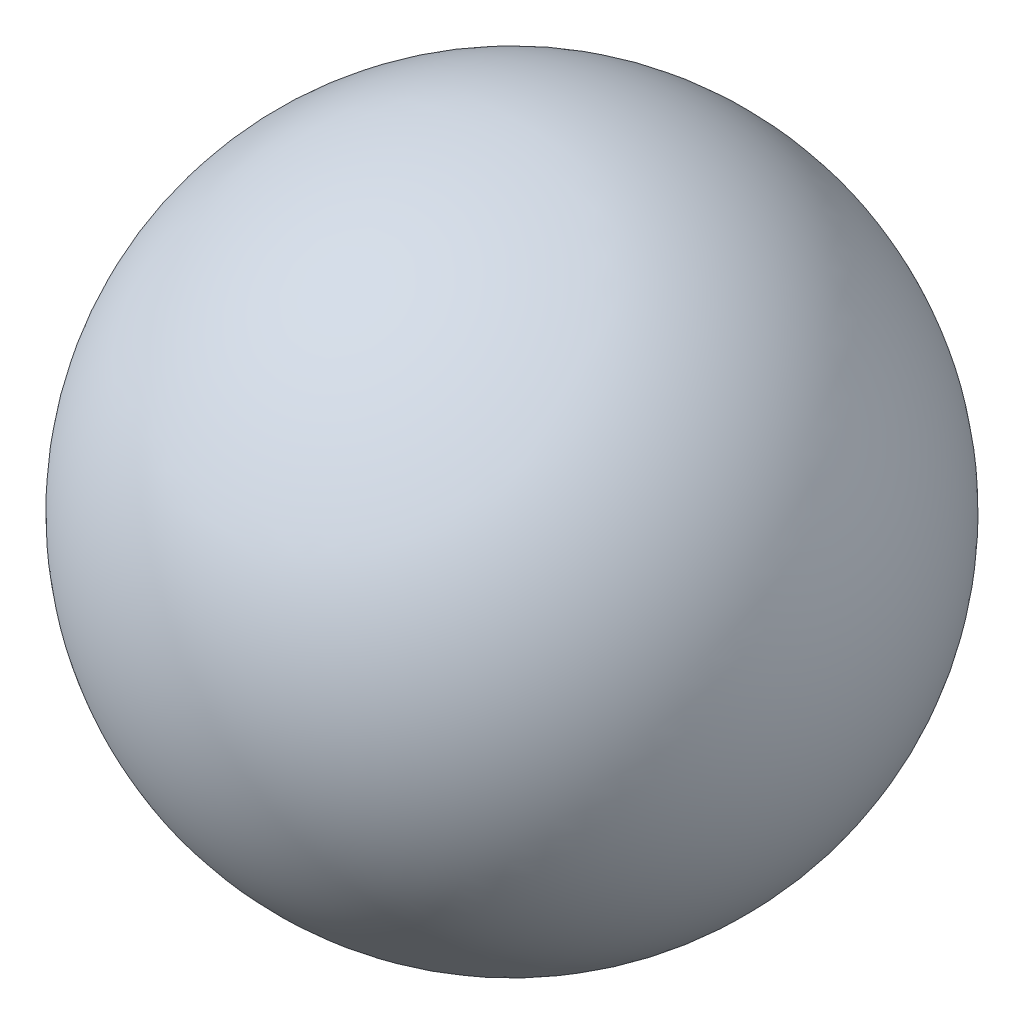
ISO-10303-21;
HEADER;
FILE_DESCRIPTION(('STEP AP214'),'2;1');
FILE_NAME('part.step','',(''),(''),'','','');
FILE_SCHEMA(('AUTOMOTIVE_DESIGN { 1 0 10303 214 1 1 1 1 }'));
ENDSEC;
DATA;
#1=APPLICATION_CONTEXT('core data for automotive mechanical design processes');
#2=APPLICATION_PROTOCOL_DEFINITION('international standard','automotive_design',2000,#1);
#3=PRODUCT_CONTEXT('',#1,'mechanical');
#4=PRODUCT('Part','Part','',(#3));
#5=PRODUCT_RELATED_PRODUCT_CATEGORY('part','',(#4));
#6=PRODUCT_DEFINITION_FORMATION('','',#4);
#7=PRODUCT_DEFINITION_CONTEXT('part definition',#1,'design');
#8=PRODUCT_DEFINITION('design','',#6,#7);
#9=PRODUCT_DEFINITION_SHAPE('','',#8);
#10=(LENGTH_UNIT() NAMED_UNIT(*) SI_UNIT(.MILLI.,.METRE.));
#11=(NAMED_UNIT(*) PLANE_ANGLE_UNIT() SI_UNIT($,.RADIAN.));
#12=(NAMED_UNIT(*) SI_UNIT($,.STERADIAN.) SOLID_ANGLE_UNIT());
#13=UNCERTAINTY_MEASURE_WITH_UNIT(LENGTH_MEASURE(1.E-05),#10,'distance_accuracy_value','');
#14=(GEOMETRIC_REPRESENTATION_CONTEXT(3) GLOBAL_UNCERTAINTY_ASSIGNED_CONTEXT((#13)) GLOBAL_UNIT_ASSIGNED_CONTEXT((#10,
#11,#12)) REPRESENTATION_CONTEXT('',''));
#15=CARTESIAN_POINT('',(0.,0.,0.));
#16=DIRECTION('',(0.,0.,1.));
#17=DIRECTION('',(1.,0.,0.));
#18=AXIS2_PLACEMENT_3D('',#15,#16,#17);
#19=CARTESIAN_POINT('',(0.,0.,0.));
#20=DIRECTION('',(0.,0.,-1.));
#21=DIRECTION('',(1.,0.,0.));
#22=AXIS2_PLACEMENT_3D('',#19,#20,#21);
#23=SPHERICAL_SURFACE('',#22,0.25);
#24=CARTESIAN_POINT('',(0.,0.,-0.25));
#25=VERTEX_POINT('',#24);
#26=VERTEX_LOOP('',#25);
#27=FACE_BOUND('',#26,.T.);
#28=ADVANCED_FACE('F28',(#27),#23,.T.);
#29=CLOSED_SHELL('',(#28));
#30=MANIFOLD_SOLID_BREP('B2',#29);
#31=ADVANCED_BREP_SHAPE_REPRESENTATION('',(#18,#30),#14);
#32=SHAPE_DEFINITION_REPRESENTATION(#9,#31);
ENDSEC;
END-ISO-10303-21;
